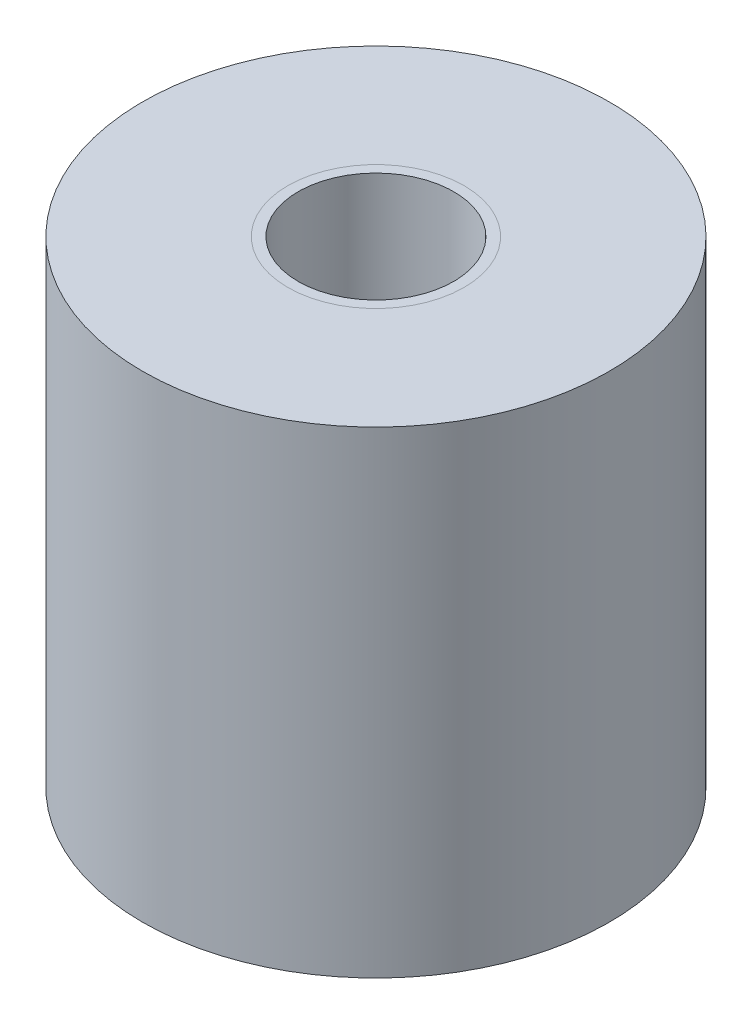
ISO-10303-21;
HEADER;
FILE_DESCRIPTION(('STEP AP214'),'2;1');
FILE_NAME('part.step','',(''),(''),'','','');
FILE_SCHEMA(('AUTOMOTIVE_DESIGN { 1 0 10303 214 1 1 1 1 }'));
ENDSEC;
DATA;
#1=APPLICATION_CONTEXT('core data for automotive mechanical design processes');
#2=APPLICATION_PROTOCOL_DEFINITION('international standard','automotive_design',2000,#1);
#3=PRODUCT_CONTEXT('',#1,'mechanical');
#4=PRODUCT('Part','Part','',(#3));
#5=PRODUCT_RELATED_PRODUCT_CATEGORY('part','',(#4));
#6=PRODUCT_DEFINITION_FORMATION('','',#4);
#7=PRODUCT_DEFINITION_CONTEXT('part definition',#1,'design');
#8=PRODUCT_DEFINITION('design','',#6,#7);
#9=PRODUCT_DEFINITION_SHAPE('','',#8);
#10=(LENGTH_UNIT() NAMED_UNIT(*) SI_UNIT(.MILLI.,.METRE.));
#11=(NAMED_UNIT(*) PLANE_ANGLE_UNIT() SI_UNIT($,.RADIAN.));
#12=(NAMED_UNIT(*) SI_UNIT($,.STERADIAN.) SOLID_ANGLE_UNIT());
#13=UNCERTAINTY_MEASURE_WITH_UNIT(LENGTH_MEASURE(1.E-05),#10,'distance_accuracy_value','');
#14=(GEOMETRIC_REPRESENTATION_CONTEXT(3) GLOBAL_UNCERTAINTY_ASSIGNED_CONTEXT((#13)) GLOBAL_UNIT_ASSIGNED_CONTEXT((#10,
#11,#12)) REPRESENTATION_CONTEXT('',''));
#15=CARTESIAN_POINT('',(0.,0.,0.));
#16=DIRECTION('',(0.,0.,1.));
#17=DIRECTION('',(1.,0.,0.));
#18=AXIS2_PLACEMENT_3D('',#15,#16,#17);
#19=CARTESIAN_POINT('',(0.,0.,0.));
#20=DIRECTION('',(0.,1.,0.));
#21=DIRECTION('',(0.,0.,1.));
#22=AXIS2_PLACEMENT_3D('',#19,#20,#21);
#23=PLANE('',#22);
#24=CARTESIAN_POINT('',(0.,0.,0.));
#25=DIRECTION('',(0.,1.,0.));
#26=DIRECTION('',(0.,0.,1.));
#27=AXIS2_PLACEMENT_3D('',#24,#25,#26);
#28=CIRCLE('',#27,57.15);
#29=CARTESIAN_POINT('',(0.,0.,57.15));
#30=VERTEX_POINT('',#29);
#31=EDGE_CURVE('E53',#30,#30,#28,.T.);
#32=ORIENTED_EDGE('',*,*,#31,.F.);
#33=EDGE_LOOP('',(#32));
#34=FACE_BOUND('',#33,.T.);
#35=CARTESIAN_POINT('',(0.,0.,0.));
#36=DIRECTION('',(0.,1.,0.));
#37=DIRECTION('',(0.,0.,1.));
#38=AXIS2_PLACEMENT_3D('',#35,#36,#37);
#39=CIRCLE('',#38,21.59);
#40=CARTESIAN_POINT('',(0.,0.,21.59));
#41=VERTEX_POINT('',#40);
#42=EDGE_CURVE('E10',#41,#41,#39,.F.);
#43=ORIENTED_EDGE('',*,*,#42,.F.);
#44=EDGE_LOOP('',(#43));
#45=FACE_BOUND('',#44,.T.);
#46=ADVANCED_FACE('F36',(#34,#45),#23,.F.);
#47=CARTESIAN_POINT('',(0.,116.84,0.));
#48=DIRECTION('',(0.,1.,0.));
#49=DIRECTION('',(0.,0.,1.));
#50=AXIS2_PLACEMENT_3D('',#47,#48,#49);
#51=PLANE('',#50);
#52=CARTESIAN_POINT('',(0.,116.84,0.));
#53=DIRECTION('',(0.,1.,0.));
#54=DIRECTION('',(0.,0.,1.));
#55=AXIS2_PLACEMENT_3D('',#52,#53,#54);
#56=CIRCLE('',#55,57.15);
#57=CARTESIAN_POINT('',(0.,116.84,57.15));
#58=VERTEX_POINT('',#57);
#59=EDGE_CURVE('E51',#58,#58,#56,.T.);
#60=ORIENTED_EDGE('',*,*,#59,.T.);
#61=EDGE_LOOP('',(#60));
#62=FACE_BOUND('',#61,.T.);
#63=CARTESIAN_POINT('',(0.,116.84,0.));
#64=DIRECTION('',(0.,1.,0.));
#65=DIRECTION('',(0.,0.,1.));
#66=AXIS2_PLACEMENT_3D('',#63,#64,#65);
#67=CIRCLE('',#66,21.59);
#68=CARTESIAN_POINT('',(0.,116.84,21.59));
#69=VERTEX_POINT('',#68);
#70=EDGE_CURVE('E40',#69,#69,#67,.F.);
#71=ORIENTED_EDGE('',*,*,#70,.T.);
#72=EDGE_LOOP('',(#71));
#73=FACE_BOUND('',#72,.T.);
#74=ADVANCED_FACE('F71',(#62,#73),#51,.T.);
#75=ORIENTED_EDGE('',*,*,#70,.F.);
#76=EDGE_LOOP('',(#75));
#77=FACE_BOUND('',#76,.T.);
#78=CARTESIAN_POINT('',(0.,116.84,0.));
#79=DIRECTION('',(0.,1.,0.));
#80=DIRECTION('',(0.,0.,1.));
#81=AXIS2_PLACEMENT_3D('',#78,#79,#80);
#82=CIRCLE('',#81,19.05);
#83=CARTESIAN_POINT('',(0.,116.84,19.05));
#84=VERTEX_POINT('',#83);
#85=EDGE_CURVE('E56',#84,#84,#82,.T.);
#86=ORIENTED_EDGE('',*,*,#85,.F.);
#87=EDGE_LOOP('',(#86));
#88=FACE_BOUND('',#87,.T.);
#89=ADVANCED_FACE('F68',(#77,#88),#51,.T.);
#90=ORIENTED_EDGE('',*,*,#42,.T.);
#91=EDGE_LOOP('',(#90));
#92=FACE_BOUND('',#91,.T.);
#93=CARTESIAN_POINT('',(0.,0.,0.));
#94=DIRECTION('',(0.,1.,0.));
#95=DIRECTION('',(0.,0.,1.));
#96=AXIS2_PLACEMENT_3D('',#93,#94,#95);
#97=CIRCLE('',#96,19.05);
#98=CARTESIAN_POINT('',(0.,0.,19.05));
#99=VERTEX_POINT('',#98);
#100=EDGE_CURVE('E59',#99,#99,#97,.T.);
#101=ORIENTED_EDGE('',*,*,#100,.T.);
#102=EDGE_LOOP('',(#101));
#103=FACE_BOUND('',#102,.T.);
#104=ADVANCED_FACE('F70',(#92,#103),#23,.F.);
#105=CARTESIAN_POINT('',(0.,116.84,0.));
#106=DIRECTION('',(0.,-1.,0.));
#107=DIRECTION('',(0.,0.,-1.));
#108=AXIS2_PLACEMENT_3D('',#105,#106,#107);
#109=CYLINDRICAL_SURFACE('',#108,57.15);
#110=ORIENTED_EDGE('',*,*,#59,.F.);
#111=EDGE_LOOP('',(#110));
#112=FACE_BOUND('',#111,.T.);
#113=ORIENTED_EDGE('',*,*,#31,.T.);
#114=EDGE_LOOP('',(#113));
#115=FACE_BOUND('',#114,.T.);
#116=ADVANCED_FACE('F38',(#112,#115),#109,.T.);
#117=CARTESIAN_POINT('',(0.,116.84,0.));
#118=DIRECTION('',(0.,-1.,0.));
#119=DIRECTION('',(0.,0.,-1.));
#120=AXIS2_PLACEMENT_3D('',#117,#118,#119);
#121=CYLINDRICAL_SURFACE('',#120,19.05);
#122=ORIENTED_EDGE('',*,*,#85,.T.);
#123=EDGE_LOOP('',(#122));
#124=FACE_BOUND('',#123,.T.);
#125=ORIENTED_EDGE('',*,*,#100,.F.);
#126=EDGE_LOOP('',(#125));
#127=FACE_BOUND('',#126,.T.);
#128=ADVANCED_FACE('F65',(#124,#127),#121,.F.);
#129=CLOSED_SHELL('',(#46,#74,#89,#104,#116,#128));
#130=MANIFOLD_SOLID_BREP('B2',#129);
#131=ADVANCED_BREP_SHAPE_REPRESENTATION('',(#18,#130),#14);
#132=SHAPE_DEFINITION_REPRESENTATION(#9,#131);
ENDSEC;
END-ISO-10303-21;
